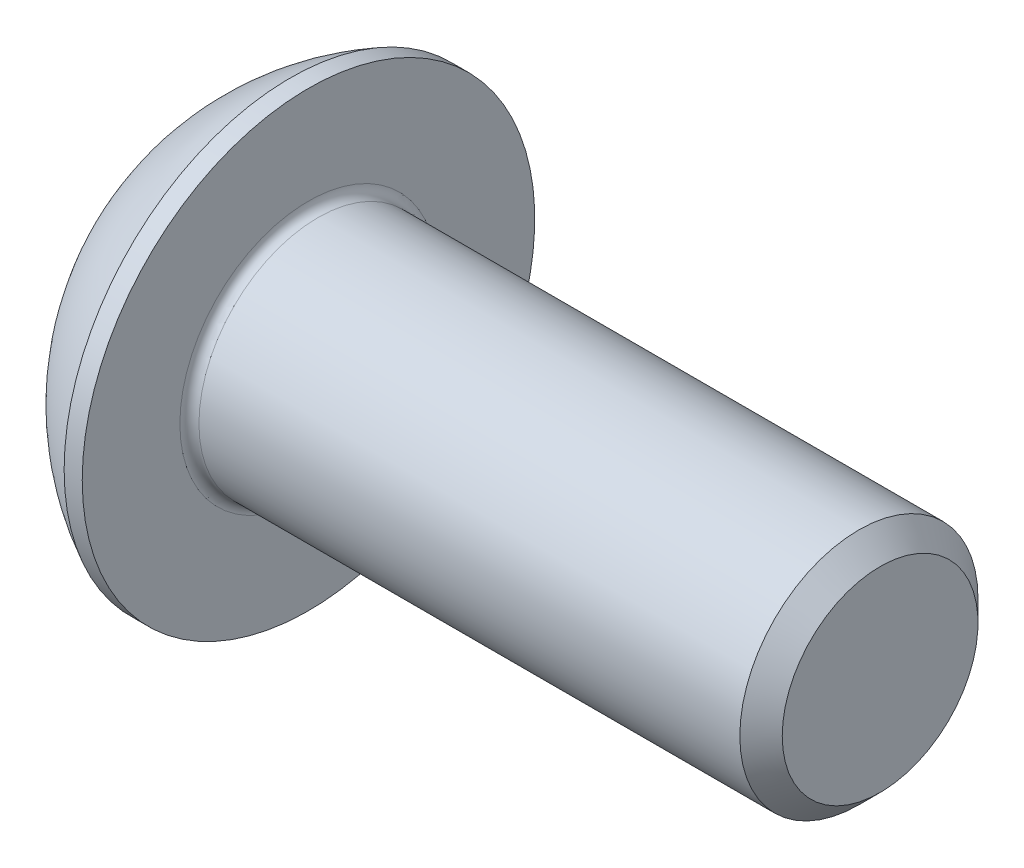
ISO-10303-21;
HEADER;
FILE_DESCRIPTION(('STEP AP214'),'2;1');
FILE_NAME('part.step','',(''),(''),'','','');
FILE_SCHEMA(('AUTOMOTIVE_DESIGN { 1 0 10303 214 1 1 1 1 }'));
ENDSEC;
DATA;
#1=APPLICATION_CONTEXT('core data for automotive mechanical design processes');
#2=APPLICATION_PROTOCOL_DEFINITION('international standard','automotive_design',2000,#1);
#3=PRODUCT_CONTEXT('',#1,'mechanical');
#4=PRODUCT('Part','Part','',(#3));
#5=PRODUCT_RELATED_PRODUCT_CATEGORY('part','',(#4));
#6=PRODUCT_DEFINITION_FORMATION('','',#4);
#7=PRODUCT_DEFINITION_CONTEXT('part definition',#1,'design');
#8=PRODUCT_DEFINITION('design','',#6,#7);
#9=PRODUCT_DEFINITION_SHAPE('','',#8);
#10=(LENGTH_UNIT() NAMED_UNIT(*) SI_UNIT(.MILLI.,.METRE.));
#11=(NAMED_UNIT(*) PLANE_ANGLE_UNIT() SI_UNIT($,.RADIAN.));
#12=(NAMED_UNIT(*) SI_UNIT($,.STERADIAN.) SOLID_ANGLE_UNIT());
#13=UNCERTAINTY_MEASURE_WITH_UNIT(LENGTH_MEASURE(1.E-05),#10,'distance_accuracy_value','');
#14=(GEOMETRIC_REPRESENTATION_CONTEXT(3) GLOBAL_UNCERTAINTY_ASSIGNED_CONTEXT((#13)) GLOBAL_UNIT_ASSIGNED_CONTEXT((#10,
#11,#12)) REPRESENTATION_CONTEXT('',''));
#15=CARTESIAN_POINT('',(0.,0.,0.));
#16=DIRECTION('',(0.,0.,1.));
#17=DIRECTION('',(1.,0.,0.));
#18=AXIS2_PLACEMENT_3D('',#15,#16,#17);
#19=CARTESIAN_POINT('',(0.,0.,0.));
#20=DIRECTION('',(-1.,0.,0.));
#21=DIRECTION('',(0.,0.,1.));
#22=AXIS2_PLACEMENT_3D('',#19,#20,#21);
#23=PLANE('',#22);
#24=CARTESIAN_POINT('',(0.,0.,0.));
#25=DIRECTION('',(-1.,0.,0.));
#26=DIRECTION('',(0.,0.,1.));
#27=AXIS2_PLACEMENT_3D('',#24,#25,#26);
#28=CIRCLE('',#27,2.375);
#29=CARTESIAN_POINT('',(0.,0.,2.375));
#30=VERTEX_POINT('',#29);
#31=EDGE_CURVE('E163',#30,#30,#28,.T.);
#32=ORIENTED_EDGE('',*,*,#31,.T.);
#33=EDGE_LOOP('',(#32));
#34=FACE_BOUND('',#33,.T.);
#35=DIRECTION('',(0.,-1.,0.));
#36=VECTOR('',#35,1.);
#37=CARTESIAN_POINT('',(0.,-0.866025403784438,1.5));
#38=LINE('',#37,#36);
#39=CARTESIAN_POINT('',(0.,0.866025403784439,1.5));
#40=VERTEX_POINT('',#39);
#41=CARTESIAN_POINT('',(0.,-0.866025403784438,1.5));
#42=VERTEX_POINT('',#41);
#43=EDGE_CURVE('E53',#40,#42,#38,.T.);
#44=ORIENTED_EDGE('',*,*,#43,.T.);
#45=DIRECTION('',(0.,-0.5,-0.866025403784439));
#46=VECTOR('',#45,1.);
#47=CARTESIAN_POINT('',(0.,-1.73205080756888,0.));
#48=LINE('',#47,#46);
#49=CARTESIAN_POINT('',(0.,-1.73205080756888,0.));
#50=VERTEX_POINT('',#49);
#51=EDGE_CURVE('E256',#42,#50,#48,.T.);
#52=ORIENTED_EDGE('',*,*,#51,.T.);
#53=DIRECTION('',(0.,0.5,-0.866025403784439));
#54=VECTOR('',#53,1.);
#55=CARTESIAN_POINT('',(0.,-0.866025403784438,-1.5));
#56=LINE('',#55,#54);
#57=CARTESIAN_POINT('',(0.,-0.866025403784438,-1.5));
#58=VERTEX_POINT('',#57);
#59=EDGE_CURVE('E138',#50,#58,#56,.T.);
#60=ORIENTED_EDGE('',*,*,#59,.T.);
#61=DIRECTION('',(0.,1.,0.));
#62=VECTOR('',#61,1.);
#63=CARTESIAN_POINT('',(0.,0.866025403784439,-1.5));
#64=LINE('',#63,#62);
#65=CARTESIAN_POINT('',(0.,0.866025403784439,-1.5));
#66=VERTEX_POINT('',#65);
#67=EDGE_CURVE('E259',#58,#66,#64,.T.);
#68=ORIENTED_EDGE('',*,*,#67,.T.);
#69=DIRECTION('',(0.,0.5,0.866025403784439));
#70=VECTOR('',#69,1.);
#71=CARTESIAN_POINT('',(0.,1.73205080756888,0.));
#72=LINE('',#71,#70);
#73=CARTESIAN_POINT('',(0.,1.73205080756888,0.));
#74=VERTEX_POINT('',#73);
#75=EDGE_CURVE('E261',#66,#74,#72,.T.);
#76=ORIENTED_EDGE('',*,*,#75,.T.);
#77=DIRECTION('',(0.,-0.5,0.866025403784439));
#78=VECTOR('',#77,1.);
#79=CARTESIAN_POINT('',(0.,0.866025403784439,1.5));
#80=LINE('',#79,#78);
#81=EDGE_CURVE('E263',#74,#40,#80,.T.);
#82=ORIENTED_EDGE('',*,*,#81,.T.);
#83=EDGE_LOOP('',(#44,#52,#60,#68,#76,#82));
#84=FACE_BOUND('',#83,.T.);
#85=ADVANCED_FACE('F38',(#34,#84),#23,.T.);
#86=CARTESIAN_POINT('',(4.75501582278481,0.,0.));
#87=DIRECTION('',(-1.,0.,0.));
#88=DIRECTION('',(0.,1.,0.));
#89=AXIS2_PLACEMENT_3D('',#86,#87,#88);
#90=SPHERICAL_SURFACE('',#89,5.3151482081814);
#91=CARTESIAN_POINT('',(2.37,0.,0.));
#92=DIRECTION('',(-1.,0.,0.));
#93=DIRECTION('',(0.,0.,1.));
#94=AXIS2_PLACEMENT_3D('',#91,#92,#93);
#95=CIRCLE('',#94,4.75);
#96=CARTESIAN_POINT('',(2.37,0.,4.75));
#97=VERTEX_POINT('',#96);
#98=EDGE_CURVE('E160',#97,#97,#95,.T.);
#99=ORIENTED_EDGE('',*,*,#98,.T.);
#100=EDGE_LOOP('',(#99));
#101=FACE_BOUND('',#100,.T.);
#102=ORIENTED_EDGE('',*,*,#31,.F.);
#103=EDGE_LOOP('',(#102));
#104=FACE_BOUND('',#103,.T.);
#105=ADVANCED_FACE('F184',(#101,#104),#90,.T.);
#106=CARTESIAN_POINT('',(0.,0.,0.));
#107=DIRECTION('',(-1.,0.,0.));
#108=DIRECTION('',(0.,0.,1.));
#109=AXIS2_PLACEMENT_3D('',#106,#107,#108);
#110=CYLINDRICAL_SURFACE('',#109,4.75);
#111=ORIENTED_EDGE('',*,*,#98,.F.);
#112=EDGE_LOOP('',(#111));
#113=FACE_BOUND('',#112,.T.);
#114=CARTESIAN_POINT('',(2.75,0.,0.));
#115=DIRECTION('',(-1.,0.,0.));
#116=DIRECTION('',(0.,0.,1.));
#117=AXIS2_PLACEMENT_3D('',#114,#115,#116);
#118=CIRCLE('',#117,4.75);
#119=CARTESIAN_POINT('',(2.75,0.,4.75));
#120=VERTEX_POINT('',#119);
#121=EDGE_CURVE('E157',#120,#120,#118,.T.);
#122=ORIENTED_EDGE('',*,*,#121,.T.);
#123=EDGE_LOOP('',(#122));
#124=FACE_BOUND('',#123,.T.);
#125=ADVANCED_FACE('F189',(#113,#124),#110,.T.);
#126=CARTESIAN_POINT('',(2.75,2.5,0.));
#127=DIRECTION('',(-1.,0.,0.));
#128=DIRECTION('',(0.,0.,1.));
#129=AXIS2_PLACEMENT_3D('',#126,#127,#128);
#130=PLANE('',#129);
#131=CARTESIAN_POINT('',(2.75,0.,0.));
#132=DIRECTION('',(-1.,0.,0.));
#133=DIRECTION('',(0.,0.,1.));
#134=AXIS2_PLACEMENT_3D('',#131,#132,#133);
#135=CIRCLE('',#134,2.7);
#136=CARTESIAN_POINT('',(2.75,0.,2.7));
#137=VERTEX_POINT('',#136);
#138=EDGE_CURVE('E46',#137,#137,#135,.T.);
#139=ORIENTED_EDGE('',*,*,#138,.T.);
#140=EDGE_LOOP('',(#139));
#141=FACE_BOUND('',#140,.T.);
#142=ORIENTED_EDGE('',*,*,#121,.F.);
#143=EDGE_LOOP('',(#142));
#144=FACE_BOUND('',#143,.T.);
#145=ADVANCED_FACE('F168',(#141,#144),#130,.F.);
#146=CARTESIAN_POINT('',(0.,0.,0.));
#147=DIRECTION('',(-1.,0.,0.));
#148=DIRECTION('',(0.,0.,1.));
#149=AXIS2_PLACEMENT_3D('',#146,#147,#148);
#150=CYLINDRICAL_SURFACE('',#149,2.5);
#151=CARTESIAN_POINT('',(2.95,0.,0.));
#152=DIRECTION('',(-1.,0.,0.));
#153=DIRECTION('',(0.,0.,1.));
#154=AXIS2_PLACEMENT_3D('',#151,#152,#153);
#155=CIRCLE('',#154,2.5);
#156=CARTESIAN_POINT('',(2.95,0.,2.5));
#157=VERTEX_POINT('',#156);
#158=EDGE_CURVE('E11',#157,#157,#155,.F.);
#159=ORIENTED_EDGE('',*,*,#158,.T.);
#160=EDGE_LOOP('',(#159));
#161=FACE_BOUND('',#160,.T.);
#162=CARTESIAN_POINT('',(14.305,0.,0.));
#163=DIRECTION('',(-1.,0.,0.));
#164=DIRECTION('',(0.,0.,1.));
#165=AXIS2_PLACEMENT_3D('',#162,#163,#164);
#166=CIRCLE('',#165,2.5);
#167=CARTESIAN_POINT('',(14.305,0.,2.5));
#168=VERTEX_POINT('',#167);
#169=EDGE_CURVE('E154',#168,#168,#166,.T.);
#170=ORIENTED_EDGE('',*,*,#169,.T.);
#171=EDGE_LOOP('',(#170));
#172=FACE_BOUND('',#171,.T.);
#173=ADVANCED_FACE('F198',(#161,#172),#150,.T.);
#174=CARTESIAN_POINT('',(14.75,0.,0.));
#175=DIRECTION('',(-1.,0.,0.));
#176=DIRECTION('',(0.,0.,1.));
#177=AXIS2_PLACEMENT_3D('',#174,#175,#176);
#178=CONICAL_SURFACE('',#177,2.055,0.785398163397444);
#179=ORIENTED_EDGE('',*,*,#169,.F.);
#180=EDGE_LOOP('',(#179));
#181=FACE_BOUND('',#180,.T.);
#182=CARTESIAN_POINT('',(14.75,0.,0.));
#183=DIRECTION('',(-1.,0.,0.));
#184=DIRECTION('',(0.,0.,1.));
#185=AXIS2_PLACEMENT_3D('',#182,#183,#184);
#186=CIRCLE('',#185,2.055);
#187=CARTESIAN_POINT('',(14.75,0.,2.055));
#188=VERTEX_POINT('',#187);
#189=EDGE_CURVE('E150',#188,#188,#186,.T.);
#190=ORIENTED_EDGE('',*,*,#189,.T.);
#191=EDGE_LOOP('',(#190));
#192=FACE_BOUND('',#191,.T.);
#193=ADVANCED_FACE('F179',(#181,#192),#178,.T.);
#194=CARTESIAN_POINT('',(14.75,0.,0.));
#195=DIRECTION('',(-1.,0.,0.));
#196=DIRECTION('',(0.,0.,1.));
#197=AXIS2_PLACEMENT_3D('',#194,#195,#196);
#198=PLANE('',#197);
#199=ORIENTED_EDGE('',*,*,#189,.F.);
#200=EDGE_LOOP('',(#199));
#201=FACE_BOUND('',#200,.T.);
#202=ADVANCED_FACE('F172',(#201),#198,.F.);
#203=CARTESIAN_POINT('',(2.95,0.,0.));
#204=DIRECTION('',(-1.,0.,0.));
#205=DIRECTION('',(0.,0.,1.));
#206=AXIS2_PLACEMENT_3D('',#203,#204,#205);
#207=TOROIDAL_SURFACE('',#206,2.7,0.2);
#208=ORIENTED_EDGE('',*,*,#158,.F.);
#209=EDGE_LOOP('',(#208));
#210=FACE_BOUND('',#209,.T.);
#211=ORIENTED_EDGE('',*,*,#138,.F.);
#212=EDGE_LOOP('',(#211));
#213=FACE_BOUND('',#212,.T.);
#214=ADVANCED_FACE('F40',(#210,#213),#207,.F.);
#215=CARTESIAN_POINT('',(1.56,-1.73205080756888,0.));
#216=DIRECTION('',(0.,0.866025403784439,-0.5));
#217=DIRECTION('',(0.,0.5,0.866025403784439));
#218=AXIS2_PLACEMENT_3D('',#215,#216,#217);
#219=PLANE('',#218);
#220=DIRECTION('',(0.,-0.5,-0.866025403784439));
#221=VECTOR('',#220,1.);
#222=CARTESIAN_POINT('',(1.56,-1.73205080756888,0.));
#223=LINE('',#222,#221);
#224=CARTESIAN_POINT('',(1.56,-0.866025403784438,1.5));
#225=VERTEX_POINT('',#224);
#226=CARTESIAN_POINT('',(1.56,-1.29903810567666,0.749999999999999));
#227=VERTEX_POINT('',#226);
#228=EDGE_CURVE('E121',#225,#227,#223,.T.);
#229=ORIENTED_EDGE('',*,*,#228,.T.);
#230=CARTESIAN_POINT('',(1.56,-1.73205080756888,0.));
#231=VERTEX_POINT('',#230);
#232=EDGE_CURVE('E114',#227,#231,#223,.T.);
#233=ORIENTED_EDGE('',*,*,#232,.T.);
#234=DIRECTION('',(-1.,0.,0.));
#235=VECTOR('',#234,1.);
#236=CARTESIAN_POINT('',(1.56,-1.73205080756888,0.));
#237=LINE('',#236,#235);
#238=EDGE_CURVE('E118',#231,#50,#237,.T.);
#239=ORIENTED_EDGE('',*,*,#238,.T.);
#240=ORIENTED_EDGE('',*,*,#51,.F.);
#241=DIRECTION('',(-1.,0.,0.));
#242=VECTOR('',#241,1.);
#243=CARTESIAN_POINT('',(1.56,-0.866025403784438,1.5));
#244=LINE('',#243,#242);
#245=EDGE_CURVE('E246',#225,#42,#244,.T.);
#246=ORIENTED_EDGE('',*,*,#245,.F.);
#247=EDGE_LOOP('',(#229,#233,#239,#240,#246));
#248=FACE_BOUND('',#247,.T.);
#249=ADVANCED_FACE('F116',(#248),#219,.T.);
#250=CARTESIAN_POINT('',(1.56,-0.866025403784438,-1.5));
#251=DIRECTION('',(0.,0.866025403784439,0.5));
#252=DIRECTION('',(0.,-0.5,0.866025403784439));
#253=AXIS2_PLACEMENT_3D('',#250,#251,#252);
#254=PLANE('',#253);
#255=DIRECTION('',(0.,0.5,-0.866025403784439));
#256=VECTOR('',#255,1.);
#257=CARTESIAN_POINT('',(1.56,-0.866025403784438,-1.5));
#258=LINE('',#257,#256);
#259=CARTESIAN_POINT('',(1.56,-1.29903810567666,-0.749999999999999));
#260=VERTEX_POINT('',#259);
#261=EDGE_CURVE('E126',#231,#260,#258,.T.);
#262=ORIENTED_EDGE('',*,*,#261,.T.);
#263=CARTESIAN_POINT('',(1.56,-0.866025403784438,-1.5));
#264=VERTEX_POINT('',#263);
#265=EDGE_CURVE('E133',#260,#264,#258,.T.);
#266=ORIENTED_EDGE('',*,*,#265,.T.);
#267=DIRECTION('',(-1.,0.,0.));
#268=VECTOR('',#267,1.);
#269=CARTESIAN_POINT('',(1.56,-0.866025403784438,-1.5));
#270=LINE('',#269,#268);
#271=EDGE_CURVE('E140',#264,#58,#270,.T.);
#272=ORIENTED_EDGE('',*,*,#271,.T.);
#273=ORIENTED_EDGE('',*,*,#59,.F.);
#274=ORIENTED_EDGE('',*,*,#238,.F.);
#275=EDGE_LOOP('',(#262,#266,#272,#273,#274));
#276=FACE_BOUND('',#275,.T.);
#277=ADVANCED_FACE('F136',(#276),#254,.T.);
#278=CARTESIAN_POINT('',(1.56,0.866025403784439,-1.5));
#279=DIRECTION('',(0.,0.,1.));
#280=DIRECTION('',(1.,0.,0.));
#281=AXIS2_PLACEMENT_3D('',#278,#279,#280);
#282=PLANE('',#281);
#283=DIRECTION('',(0.,1.,0.));
#284=VECTOR('',#283,1.);
#285=CARTESIAN_POINT('',(1.56,0.866025403784439,-1.5));
#286=LINE('',#285,#284);
#287=CARTESIAN_POINT('',(1.56,0.,-1.5));
#288=VERTEX_POINT('',#287);
#289=EDGE_CURVE('E282',#264,#288,#286,.T.);
#290=ORIENTED_EDGE('',*,*,#289,.T.);
#291=CARTESIAN_POINT('',(1.56,0.866025403784439,-1.5));
#292=VERTEX_POINT('',#291);
#293=EDGE_CURVE('E132',#288,#292,#286,.T.);
#294=ORIENTED_EDGE('',*,*,#293,.T.);
#295=DIRECTION('',(-1.,0.,0.));
#296=VECTOR('',#295,1.);
#297=CARTESIAN_POINT('',(1.56,0.866025403784439,-1.5));
#298=LINE('',#297,#296);
#299=EDGE_CURVE('E145',#292,#66,#298,.T.);
#300=ORIENTED_EDGE('',*,*,#299,.T.);
#301=ORIENTED_EDGE('',*,*,#67,.F.);
#302=ORIENTED_EDGE('',*,*,#271,.F.);
#303=EDGE_LOOP('',(#290,#294,#300,#301,#302));
#304=FACE_BOUND('',#303,.T.);
#305=ADVANCED_FACE('F212',(#304),#282,.T.);
#306=CARTESIAN_POINT('',(1.56,1.73205080756888,0.));
#307=DIRECTION('',(0.,-0.866025403784438,0.5));
#308=DIRECTION('',(0.,-0.5,-0.866025403784439));
#309=AXIS2_PLACEMENT_3D('',#306,#307,#308);
#310=PLANE('',#309);
#311=DIRECTION('',(0.,0.5,0.866025403784439));
#312=VECTOR('',#311,1.);
#313=CARTESIAN_POINT('',(1.56,1.73205080756888,0.));
#314=LINE('',#313,#312);
#315=CARTESIAN_POINT('',(1.56,1.29903810567666,-0.750000000000001));
#316=VERTEX_POINT('',#315);
#317=EDGE_CURVE('E288',#292,#316,#314,.T.);
#318=ORIENTED_EDGE('',*,*,#317,.T.);
#319=CARTESIAN_POINT('',(1.56,1.73205080756888,0.));
#320=VERTEX_POINT('',#319);
#321=EDGE_CURVE('E286',#316,#320,#314,.T.);
#322=ORIENTED_EDGE('',*,*,#321,.T.);
#323=DIRECTION('',(-1.,0.,0.));
#324=VECTOR('',#323,1.);
#325=CARTESIAN_POINT('',(1.56,1.73205080756888,0.));
#326=LINE('',#325,#324);
#327=EDGE_CURVE('E268',#320,#74,#326,.T.);
#328=ORIENTED_EDGE('',*,*,#327,.T.);
#329=ORIENTED_EDGE('',*,*,#75,.F.);
#330=ORIENTED_EDGE('',*,*,#299,.F.);
#331=EDGE_LOOP('',(#318,#322,#328,#329,#330));
#332=FACE_BOUND('',#331,.T.);
#333=ADVANCED_FACE('F215',(#332),#310,.T.);
#334=CARTESIAN_POINT('',(1.56,0.866025403784439,1.5));
#335=DIRECTION('',(0.,-0.866025403784439,-0.5));
#336=DIRECTION('',(0.,0.5,-0.866025403784439));
#337=AXIS2_PLACEMENT_3D('',#334,#335,#336);
#338=PLANE('',#337);
#339=DIRECTION('',(0.,-0.5,0.866025403784439));
#340=VECTOR('',#339,1.);
#341=CARTESIAN_POINT('',(1.56,0.866025403784439,1.5));
#342=LINE('',#341,#340);
#343=CARTESIAN_POINT('',(1.56,1.29903810567666,0.75));
#344=VERTEX_POINT('',#343);
#345=EDGE_CURVE('E252',#320,#344,#342,.T.);
#346=ORIENTED_EDGE('',*,*,#345,.T.);
#347=CARTESIAN_POINT('',(1.56,0.866025403784439,1.5));
#348=VERTEX_POINT('',#347);
#349=EDGE_CURVE('E244',#344,#348,#342,.T.);
#350=ORIENTED_EDGE('',*,*,#349,.T.);
#351=DIRECTION('',(-1.,0.,0.));
#352=VECTOR('',#351,1.);
#353=CARTESIAN_POINT('',(1.56,0.866025403784439,1.5));
#354=LINE('',#353,#352);
#355=EDGE_CURVE('E250',#348,#40,#354,.T.);
#356=ORIENTED_EDGE('',*,*,#355,.T.);
#357=ORIENTED_EDGE('',*,*,#81,.F.);
#358=ORIENTED_EDGE('',*,*,#327,.F.);
#359=EDGE_LOOP('',(#346,#350,#356,#357,#358));
#360=FACE_BOUND('',#359,.T.);
#361=ADVANCED_FACE('F219',(#360),#338,.T.);
#362=CARTESIAN_POINT('',(1.56,-0.866025403784438,1.5));
#363=DIRECTION('',(0.,0.,-1.));
#364=DIRECTION('',(-1.,0.,0.));
#365=AXIS2_PLACEMENT_3D('',#362,#363,#364);
#366=PLANE('',#365);
#367=DIRECTION('',(0.,-1.,0.));
#368=VECTOR('',#367,1.);
#369=CARTESIAN_POINT('',(1.56,-0.866025403784438,1.5));
#370=LINE('',#369,#368);
#371=CARTESIAN_POINT('',(1.56,0.,1.5));
#372=VERTEX_POINT('',#371);
#373=EDGE_CURVE('E61',#348,#372,#370,.T.);
#374=ORIENTED_EDGE('',*,*,#373,.T.);
#375=EDGE_CURVE('E247',#372,#225,#370,.T.);
#376=ORIENTED_EDGE('',*,*,#375,.T.);
#377=ORIENTED_EDGE('',*,*,#245,.T.);
#378=ORIENTED_EDGE('',*,*,#43,.F.);
#379=ORIENTED_EDGE('',*,*,#355,.F.);
#380=EDGE_LOOP('',(#374,#376,#377,#378,#379));
#381=FACE_BOUND('',#380,.T.);
#382=ADVANCED_FACE('F223',(#381),#366,.T.);
#383=CARTESIAN_POINT('',(1.56,-0.866025403784438,1.5));
#384=DIRECTION('',(-1.,0.,0.));
#385=DIRECTION('',(0.,0.,1.));
#386=AXIS2_PLACEMENT_3D('',#383,#384,#385);
#387=PLANE('',#386);
#388=ORIENTED_EDGE('',*,*,#373,.F.);
#389=ORIENTED_EDGE('',*,*,#349,.F.);
#390=CARTESIAN_POINT('',(1.56,0.,0.));
#391=DIRECTION('',(-1.,0.,0.));
#392=DIRECTION('',(0.,0.,1.));
#393=AXIS2_PLACEMENT_3D('',#390,#391,#392);
#394=CIRCLE('',#393,1.5);
#395=EDGE_CURVE('E144',#372,#344,#394,.T.);
#396=ORIENTED_EDGE('',*,*,#395,.F.);
#397=EDGE_LOOP('',(#388,#389,#396));
#398=FACE_BOUND('',#397,.T.);
#399=ADVANCED_FACE('F227',(#398),#387,.T.);
#400=ORIENTED_EDGE('',*,*,#345,.F.);
#401=ORIENTED_EDGE('',*,*,#321,.F.);
#402=EDGE_CURVE('E151',#344,#316,#394,.T.);
#403=ORIENTED_EDGE('',*,*,#402,.F.);
#404=EDGE_LOOP('',(#400,#401,#403));
#405=FACE_BOUND('',#404,.T.);
#406=ADVANCED_FACE('F235',(#405),#387,.T.);
#407=ORIENTED_EDGE('',*,*,#317,.F.);
#408=ORIENTED_EDGE('',*,*,#293,.F.);
#409=EDGE_CURVE('E293',#316,#288,#394,.T.);
#410=ORIENTED_EDGE('',*,*,#409,.F.);
#411=EDGE_LOOP('',(#407,#408,#410));
#412=FACE_BOUND('',#411,.T.);
#413=ADVANCED_FACE('F240',(#412),#387,.T.);
#414=ORIENTED_EDGE('',*,*,#289,.F.);
#415=ORIENTED_EDGE('',*,*,#265,.F.);
#416=EDGE_CURVE('E285',#288,#260,#394,.T.);
#417=ORIENTED_EDGE('',*,*,#416,.F.);
#418=EDGE_LOOP('',(#414,#415,#417));
#419=FACE_BOUND('',#418,.T.);
#420=ADVANCED_FACE('F233',(#419),#387,.T.);
#421=ORIENTED_EDGE('',*,*,#261,.F.);
#422=ORIENTED_EDGE('',*,*,#232,.F.);
#423=EDGE_CURVE('E128',#260,#227,#394,.T.);
#424=ORIENTED_EDGE('',*,*,#423,.F.);
#425=EDGE_LOOP('',(#421,#422,#424));
#426=FACE_BOUND('',#425,.T.);
#427=ADVANCED_FACE('F127',(#426),#387,.T.);
#428=ORIENTED_EDGE('',*,*,#228,.F.);
#429=ORIENTED_EDGE('',*,*,#375,.F.);
#430=EDGE_CURVE('E139',#227,#372,#394,.T.);
#431=ORIENTED_EDGE('',*,*,#430,.F.);
#432=EDGE_LOOP('',(#428,#429,#431));
#433=FACE_BOUND('',#432,.T.);
#434=ADVANCED_FACE('F207',(#433),#387,.T.);
#435=CARTESIAN_POINT('',(2.42602540378445,0.,0.));
#436=DIRECTION('',(-1.,0.,0.));
#437=DIRECTION('',(0.,0.,1.));
#438=AXIS2_PLACEMENT_3D('',#435,#436,#437);
#439=CONICAL_SURFACE('',#438,0.,1.04719755119659);
#440=ORIENTED_EDGE('',*,*,#395,.T.);
#441=ORIENTED_EDGE('',*,*,#402,.T.);
#442=ORIENTED_EDGE('',*,*,#409,.T.);
#443=ORIENTED_EDGE('',*,*,#416,.T.);
#444=ORIENTED_EDGE('',*,*,#423,.T.);
#445=ORIENTED_EDGE('',*,*,#430,.T.);
#446=EDGE_LOOP('',(#440,#441,#442,#443,#444,#445));
#447=FACE_BOUND('',#446,.T.);
#448=CARTESIAN_POINT('',(2.42602540378445,0.,0.));
#449=VERTEX_POINT('',#448);
#450=VERTEX_LOOP('',#449);
#451=FACE_BOUND('',#450,.T.);
#452=ADVANCED_FACE('F205',(#447,#451),#439,.F.);
#453=CLOSED_SHELL('',(#85,#105,#125,#145,#173,#193,#202,#214,#249,#277,#305,#333,#361,#382,#399,
#406,#413,#420,#427,#434,#452));
#454=MANIFOLD_SOLID_BREP('B2',#453);
#455=ADVANCED_BREP_SHAPE_REPRESENTATION('',(#18,#454),#14);
#456=SHAPE_DEFINITION_REPRESENTATION(#9,#455);
ENDSEC;
END-ISO-10303-21;
